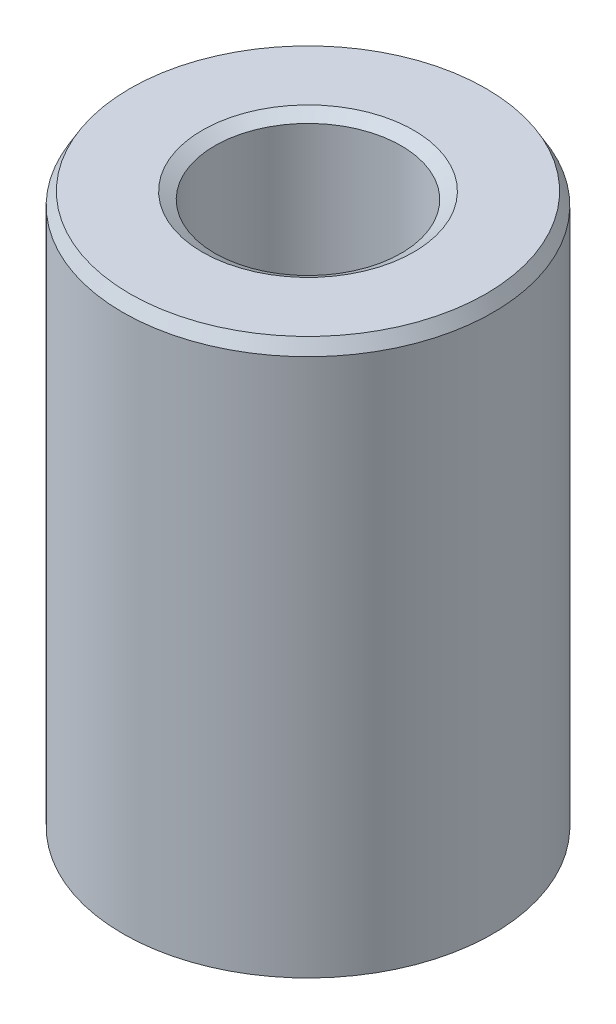
ISO-10303-21;
HEADER;
FILE_DESCRIPTION(('STEP AP214'),'2;1');
FILE_NAME('part.step','',(''),(''),'','','');
FILE_SCHEMA(('AUTOMOTIVE_DESIGN { 1 0 10303 214 1 1 1 1 }'));
ENDSEC;
DATA;
#1=APPLICATION_CONTEXT('core data for automotive mechanical design processes');
#2=APPLICATION_PROTOCOL_DEFINITION('international standard','automotive_design',2000,#1);
#3=PRODUCT_CONTEXT('',#1,'mechanical');
#4=PRODUCT('Part','Part','',(#3));
#5=PRODUCT_RELATED_PRODUCT_CATEGORY('part','',(#4));
#6=PRODUCT_DEFINITION_FORMATION('','',#4);
#7=PRODUCT_DEFINITION_CONTEXT('part definition',#1,'design');
#8=PRODUCT_DEFINITION('design','',#6,#7);
#9=PRODUCT_DEFINITION_SHAPE('','',#8);
#10=(LENGTH_UNIT() NAMED_UNIT(*) SI_UNIT(.MILLI.,.METRE.));
#11=(NAMED_UNIT(*) PLANE_ANGLE_UNIT() SI_UNIT($,.RADIAN.));
#12=(NAMED_UNIT(*) SI_UNIT($,.STERADIAN.) SOLID_ANGLE_UNIT());
#13=UNCERTAINTY_MEASURE_WITH_UNIT(LENGTH_MEASURE(1.E-05),#10,'distance_accuracy_value','');
#14=(GEOMETRIC_REPRESENTATION_CONTEXT(3) GLOBAL_UNCERTAINTY_ASSIGNED_CONTEXT((#13)) GLOBAL_UNIT_ASSIGNED_CONTEXT((#10,
#11,#12)) REPRESENTATION_CONTEXT('',''));
#15=CARTESIAN_POINT('',(0.,0.,0.));
#16=DIRECTION('',(0.,0.,1.));
#17=DIRECTION('',(1.,0.,0.));
#18=AXIS2_PLACEMENT_3D('',#15,#16,#17);
#19=CARTESIAN_POINT('',(0.,165.681292713803,0.));
#20=DIRECTION('',(0.,-1.,0.));
#21=DIRECTION('',(0.,0.,-1.));
#22=AXIS2_PLACEMENT_3D('',#19,#20,#21);
#23=CYLINDRICAL_SURFACE('',#22,55.);
#24=CARTESIAN_POINT('',(0.,2.13924525847642,0.));
#25=DIRECTION('',(0.,1.,0.));
#26=DIRECTION('',(0.,0.,1.));
#27=AXIS2_PLACEMENT_3D('',#24,#25,#26);
#28=CIRCLE('',#27,55.);
#29=CARTESIAN_POINT('',(0.,2.13924525847642,55.));
#30=VERTEX_POINT('',#29);
#31=EDGE_CURVE('E10',#30,#30,#28,.T.);
#32=ORIENTED_EDGE('',*,*,#31,.T.);
#33=EDGE_LOOP('',(#32));
#34=FACE_BOUND('',#33,.T.);
#35=CARTESIAN_POINT('',(0.,161.976011236271,0.));
#36=DIRECTION('',(0.,1.,0.));
#37=DIRECTION('',(0.,0.,1.));
#38=AXIS2_PLACEMENT_3D('',#35,#36,#37);
#39=CIRCLE('',#38,55.);
#40=CARTESIAN_POINT('',(0.,161.976011236271,55.));
#41=VERTEX_POINT('',#40);
#42=EDGE_CURVE('E50',#41,#41,#39,.F.);
#43=ORIENTED_EDGE('',*,*,#42,.T.);
#44=EDGE_LOOP('',(#43));
#45=FACE_BOUND('',#44,.T.);
#46=ADVANCED_FACE('F39',(#34,#45),#23,.T.);
#47=CARTESIAN_POINT('',(0.,165.681292713803,0.));
#48=DIRECTION('',(0.,1.,0.));
#49=DIRECTION('',(0.,0.,1.));
#50=AXIS2_PLACEMENT_3D('',#47,#48,#49);
#51=PLANE('',#50);
#52=CARTESIAN_POINT('',(0.,165.681292713803,0.));
#53=DIRECTION('',(0.,1.,0.));
#54=DIRECTION('',(0.,0.,1.));
#55=AXIS2_PLACEMENT_3D('',#52,#53,#54);
#56=CIRCLE('',#55,31.3909293098647);
#57=CARTESIAN_POINT('',(0.,165.681292713803,31.3909293098647));
#58=VERTEX_POINT('',#57);
#59=EDGE_CURVE('E58',#58,#58,#56,.F.);
#60=ORIENTED_EDGE('',*,*,#59,.T.);
#61=EDGE_LOOP('',(#60));
#62=FACE_BOUND('',#61,.T.);
#63=CARTESIAN_POINT('',(0.,165.681292713803,0.));
#64=DIRECTION('',(0.,1.,0.));
#65=DIRECTION('',(0.,0.,1.));
#66=AXIS2_PLACEMENT_3D('',#63,#64,#65);
#67=CIRCLE('',#66,52.8607547415236);
#68=CARTESIAN_POINT('',(0.,165.681292713803,52.8607547415236));
#69=VERTEX_POINT('',#68);
#70=EDGE_CURVE('E61',#69,#69,#67,.T.);
#71=ORIENTED_EDGE('',*,*,#70,.T.);
#72=EDGE_LOOP('',(#71));
#73=FACE_BOUND('',#72,.T.);
#74=ADVANCED_FACE('F88',(#62,#73),#51,.T.);
#75=CARTESIAN_POINT('',(0.,0.,0.));
#76=DIRECTION('',(0.,1.,0.));
#77=DIRECTION('',(0.,0.,1.));
#78=AXIS2_PLACEMENT_3D('',#75,#76,#77);
#79=PLANE('',#78);
#80=CARTESIAN_POINT('',(0.,0.,0.));
#81=DIRECTION('',(0.,1.,0.));
#82=DIRECTION('',(0.,0.,1.));
#83=AXIS2_PLACEMENT_3D('',#80,#81,#82);
#84=CIRCLE('',#83,29.8248930908092);
#85=CARTESIAN_POINT('',(0.,0.,29.8248930908092));
#86=VERTEX_POINT('',#85);
#87=EDGE_CURVE('E51',#86,#86,#84,.T.);
#88=ORIENTED_EDGE('',*,*,#87,.T.);
#89=EDGE_LOOP('',(#88));
#90=FACE_BOUND('',#89,.T.);
#91=CARTESIAN_POINT('',(0.,0.,0.));
#92=DIRECTION('',(0.,1.,0.));
#93=DIRECTION('',(0.,0.,1.));
#94=AXIS2_PLACEMENT_3D('',#91,#92,#93);
#95=CIRCLE('',#94,51.294718522468);
#96=CARTESIAN_POINT('',(0.,0.,51.294718522468));
#97=VERTEX_POINT('',#96);
#98=EDGE_CURVE('E54',#97,#97,#95,.F.);
#99=ORIENTED_EDGE('',*,*,#98,.T.);
#100=EDGE_LOOP('',(#99));
#101=FACE_BOUND('',#100,.T.);
#102=ADVANCED_FACE('F83',(#90,#101),#79,.F.);
#103=CARTESIAN_POINT('',(0.,165.681292713803,0.));
#104=DIRECTION('',(0.,-1.,0.));
#105=DIRECTION('',(0.,0.,-1.));
#106=AXIS2_PLACEMENT_3D('',#103,#104,#105);
#107=CYLINDRICAL_SURFACE('',#106,27.6856478323328);
#108=CARTESIAN_POINT('',(0.,163.542047455327,0.));
#109=DIRECTION('',(0.,1.,0.));
#110=DIRECTION('',(0.,0.,1.));
#111=AXIS2_PLACEMENT_3D('',#108,#109,#110);
#112=CIRCLE('',#111,27.6856478323328);
#113=CARTESIAN_POINT('',(0.,163.542047455327,27.6856478323328));
#114=VERTEX_POINT('',#113);
#115=EDGE_CURVE('E67',#114,#114,#112,.T.);
#116=ORIENTED_EDGE('',*,*,#115,.T.);
#117=EDGE_LOOP('',(#116));
#118=FACE_BOUND('',#117,.T.);
#119=CARTESIAN_POINT('',(0.,3.70528147753196,0.));
#120=DIRECTION('',(0.,1.,0.));
#121=DIRECTION('',(0.,0.,1.));
#122=AXIS2_PLACEMENT_3D('',#119,#120,#121);
#123=CIRCLE('',#122,27.6856478323328);
#124=CARTESIAN_POINT('',(0.,3.70528147753196,27.6856478323328));
#125=VERTEX_POINT('',#124);
#126=EDGE_CURVE('E69',#125,#125,#123,.F.);
#127=ORIENTED_EDGE('',*,*,#126,.T.);
#128=EDGE_LOOP('',(#127));
#129=FACE_BOUND('',#128,.T.);
#130=ADVANCED_FACE('F71',(#118,#129),#107,.F.);
#131=CARTESIAN_POINT('',(0.,163.542047455327,0.));
#132=DIRECTION('',(0.,1.,0.));
#133=DIRECTION('',(0.,0.,1.));
#134=AXIS2_PLACEMENT_3D('',#131,#132,#133);
#135=CONICAL_SURFACE('',#134,27.6856478323328,1.0471975511966);
#136=ORIENTED_EDGE('',*,*,#59,.F.);
#137=EDGE_LOOP('',(#136));
#138=FACE_BOUND('',#137,.T.);
#139=ORIENTED_EDGE('',*,*,#115,.F.);
#140=EDGE_LOOP('',(#139));
#141=FACE_BOUND('',#140,.T.);
#142=ADVANCED_FACE('F77',(#138,#141),#135,.F.);
#143=CARTESIAN_POINT('',(0.,0.,0.));
#144=DIRECTION('',(0.,-1.,0.));
#145=DIRECTION('',(0.,0.,-1.));
#146=AXIS2_PLACEMENT_3D('',#143,#144,#145);
#147=CONICAL_SURFACE('',#146,29.8248930908092,0.523598775598298);
#148=ORIENTED_EDGE('',*,*,#126,.F.);
#149=EDGE_LOOP('',(#148));
#150=FACE_BOUND('',#149,.T.);
#151=ORIENTED_EDGE('',*,*,#87,.F.);
#152=EDGE_LOOP('',(#151));
#153=FACE_BOUND('',#152,.T.);
#154=ADVANCED_FACE('F73',(#150,#153),#147,.F.);
#155=CARTESIAN_POINT('',(0.,2.13924525847642,0.));
#156=DIRECTION('',(0.,1.,0.));
#157=DIRECTION('',(0.,0.,1.));
#158=AXIS2_PLACEMENT_3D('',#155,#156,#157);
#159=CONICAL_SURFACE('',#158,55.,1.0471975511966);
#160=ORIENTED_EDGE('',*,*,#98,.F.);
#161=EDGE_LOOP('',(#160));
#162=FACE_BOUND('',#161,.T.);
#163=ORIENTED_EDGE('',*,*,#31,.F.);
#164=EDGE_LOOP('',(#163));
#165=FACE_BOUND('',#164,.T.);
#166=ADVANCED_FACE('F76',(#162,#165),#159,.T.);
#167=CARTESIAN_POINT('',(0.,165.681292713803,0.));
#168=DIRECTION('',(0.,-1.,0.));
#169=DIRECTION('',(0.,0.,-1.));
#170=AXIS2_PLACEMENT_3D('',#167,#168,#169);
#171=CONICAL_SURFACE('',#170,52.8607547415236,0.523598775598295);
#172=ORIENTED_EDGE('',*,*,#42,.F.);
#173=EDGE_LOOP('',(#172));
#174=FACE_BOUND('',#173,.T.);
#175=ORIENTED_EDGE('',*,*,#70,.F.);
#176=EDGE_LOOP('',(#175));
#177=FACE_BOUND('',#176,.T.);
#178=ADVANCED_FACE('F45',(#174,#177),#171,.T.);
#179=CLOSED_SHELL('',(#46,#74,#102,#130,#142,#154,#166,#178));
#180=MANIFOLD_SOLID_BREP('B2',#179);
#181=ADVANCED_BREP_SHAPE_REPRESENTATION('',(#18,#180),#14);
#182=SHAPE_DEFINITION_REPRESENTATION(#9,#181);
ENDSEC;
END-ISO-10303-21;
